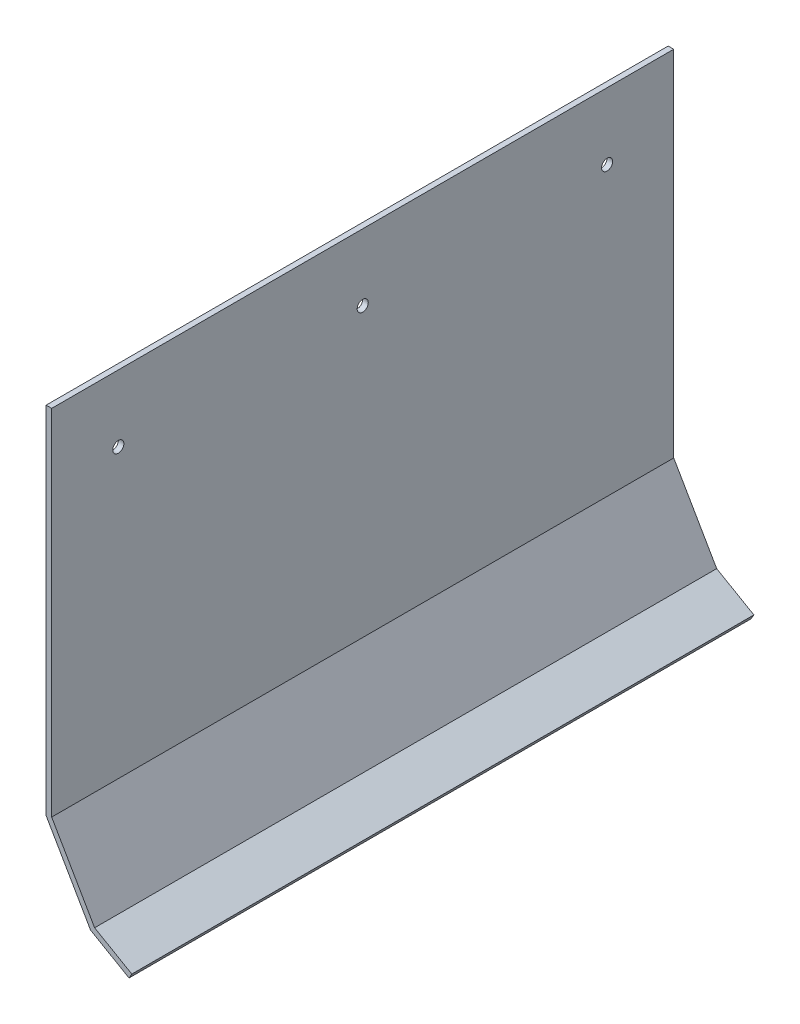
ISO-10303-21;
HEADER;
FILE_DESCRIPTION(('STEP AP214'),'2;1');
FILE_NAME('part.step','',(''),(''),'','','');
FILE_SCHEMA(('AUTOMOTIVE_DESIGN { 1 0 10303 214 1 1 1 1 }'));
ENDSEC;
DATA;
#1=APPLICATION_CONTEXT('core data for automotive mechanical design processes');
#2=APPLICATION_PROTOCOL_DEFINITION('international standard','automotive_design',2000,#1);
#3=PRODUCT_CONTEXT('',#1,'mechanical');
#4=PRODUCT('Part','Part','',(#3));
#5=PRODUCT_RELATED_PRODUCT_CATEGORY('part','',(#4));
#6=PRODUCT_DEFINITION_FORMATION('','',#4);
#7=PRODUCT_DEFINITION_CONTEXT('part definition',#1,'design');
#8=PRODUCT_DEFINITION('design','',#6,#7);
#9=PRODUCT_DEFINITION_SHAPE('','',#8);
#10=(LENGTH_UNIT() NAMED_UNIT(*) SI_UNIT(.MILLI.,.METRE.));
#11=(NAMED_UNIT(*) PLANE_ANGLE_UNIT() SI_UNIT($,.RADIAN.));
#12=(NAMED_UNIT(*) SI_UNIT($,.STERADIAN.) SOLID_ANGLE_UNIT());
#13=UNCERTAINTY_MEASURE_WITH_UNIT(LENGTH_MEASURE(1.E-05),#10,'distance_accuracy_value','');
#14=(GEOMETRIC_REPRESENTATION_CONTEXT(3) GLOBAL_UNCERTAINTY_ASSIGNED_CONTEXT((#13)) GLOBAL_UNIT_ASSIGNED_CONTEXT((#10,
#11,#12)) REPRESENTATION_CONTEXT('',''));
#15=CARTESIAN_POINT('',(0.,0.,0.));
#16=DIRECTION('',(0.,0.,1.));
#17=DIRECTION('',(1.,0.,0.));
#18=AXIS2_PLACEMENT_3D('',#15,#16,#17);
#19=CARTESIAN_POINT('',(-34.4420782014583,67.4309013813476,177.8));
#20=DIRECTION('',(1.,0.,0.));
#21=DIRECTION('',(0.,1.,0.));
#22=AXIS2_PLACEMENT_3D('',#19,#20,#21);
#23=PLANE('',#22);
#24=CARTESIAN_POINT('',(-34.4420782014583,48.3809013813468,158.75));
#25=DIRECTION('',(-1.,0.,0.));
#26=DIRECTION('',(0.,-1.,0.));
#27=AXIS2_PLACEMENT_3D('',#24,#25,#26);
#28=CIRCLE('',#27,1.58749999999999);
#29=CARTESIAN_POINT('',(-34.4420782014583,46.7934013813468,158.75));
#30=VERTEX_POINT('',#29);
#31=EDGE_CURVE('E186',#30,#30,#28,.T.);
#32=ORIENTED_EDGE('',*,*,#31,.F.);
#33=EDGE_LOOP('',(#32));
#34=FACE_BOUND('',#33,.T.);
#35=CARTESIAN_POINT('',(-34.4420782014583,48.3809013813468,88.9));
#36=DIRECTION('',(-1.,0.,0.));
#37=DIRECTION('',(0.,-1.,0.));
#38=AXIS2_PLACEMENT_3D('',#35,#36,#37);
#39=CIRCLE('',#38,1.5875);
#40=CARTESIAN_POINT('',(-34.4420782014583,46.7934013813468,88.9));
#41=VERTEX_POINT('',#40);
#42=EDGE_CURVE('E220',#41,#41,#39,.T.);
#43=ORIENTED_EDGE('',*,*,#42,.F.);
#44=EDGE_LOOP('',(#43));
#45=FACE_BOUND('',#44,.T.);
#46=CARTESIAN_POINT('',(-34.4420782014583,48.3809013813468,19.05));
#47=DIRECTION('',(-1.,0.,0.));
#48=DIRECTION('',(0.,-1.,0.));
#49=AXIS2_PLACEMENT_3D('',#46,#47,#48);
#50=CIRCLE('',#49,1.5875);
#51=CARTESIAN_POINT('',(-34.4420782014583,46.7934013813468,19.05));
#52=VERTEX_POINT('',#51);
#53=EDGE_CURVE('E224',#52,#52,#50,.T.);
#54=ORIENTED_EDGE('',*,*,#53,.F.);
#55=EDGE_LOOP('',(#54));
#56=FACE_BOUND('',#55,.T.);
#57=DIRECTION('',(0.,-1.,0.));
#58=VECTOR('',#57,1.);
#59=CARTESIAN_POINT('',(-34.4420782014583,67.4309013813476,0.));
#60=LINE('',#59,#58);
#61=CARTESIAN_POINT('',(-34.4420782014583,67.4309013813476,0.));
#62=VERTEX_POINT('',#61);
#63=CARTESIAN_POINT('',(-34.4420782014583,-34.1690986186524,0.));
#64=VERTEX_POINT('',#63);
#65=EDGE_CURVE('E142',#62,#64,#60,.T.);
#66=ORIENTED_EDGE('',*,*,#65,.T.);
#67=DIRECTION('',(0.,0.,-1.));
#68=VECTOR('',#67,1.);
#69=CARTESIAN_POINT('',(-34.4420782014583,-34.1690986186524,177.8));
#70=LINE('',#69,#68);
#71=CARTESIAN_POINT('',(-34.4420782014583,-34.1690986186524,177.8));
#72=VERTEX_POINT('',#71);
#73=EDGE_CURVE('E11',#72,#64,#70,.T.);
#74=ORIENTED_EDGE('',*,*,#73,.F.);
#75=DIRECTION('',(0.,-1.,0.));
#76=VECTOR('',#75,1.);
#77=CARTESIAN_POINT('',(-34.4420782014583,67.4309013813476,177.8));
#78=LINE('',#77,#76);
#79=CARTESIAN_POINT('',(-34.4420782014583,67.4309013813476,177.8));
#80=VERTEX_POINT('',#79);
#81=EDGE_CURVE('E164',#80,#72,#78,.T.);
#82=ORIENTED_EDGE('',*,*,#81,.F.);
#83=DIRECTION('',(0.,0.,-1.));
#84=VECTOR('',#83,1.);
#85=CARTESIAN_POINT('',(-34.4420782014583,67.4309013813476,177.8));
#86=LINE('',#85,#84);
#87=EDGE_CURVE('E138',#80,#62,#86,.T.);
#88=ORIENTED_EDGE('',*,*,#87,.T.);
#89=EDGE_LOOP('',(#66,#74,#82,#88));
#90=FACE_BOUND('',#89,.T.);
#91=ADVANCED_FACE('F39',(#34,#45,#56,#90),#23,.F.);
#92=CARTESIAN_POINT('',(-34.4420782014583,-34.1690986186524,177.8));
#93=DIRECTION('',(0.866025403784442,0.499999999999994,0.));
#94=DIRECTION('',(-0.499999999999994,0.866025403784442,0.));
#95=AXIS2_PLACEMENT_3D('',#92,#93,#94);
#96=PLANE('',#95);
#97=DIRECTION('',(0.499999999999994,-0.866025403784442,0.));
#98=VECTOR('',#97,1.);
#99=CARTESIAN_POINT('',(-34.4420782014583,-34.1690986186524,0.));
#100=LINE('',#99,#98);
#101=CARTESIAN_POINT('',(-21.7420782014584,-56.1661438747772,0.));
#102=VERTEX_POINT('',#101);
#103=EDGE_CURVE('E146',#64,#102,#100,.T.);
#104=ORIENTED_EDGE('',*,*,#103,.T.);
#105=DIRECTION('',(0.,0.,-1.));
#106=VECTOR('',#105,1.);
#107=CARTESIAN_POINT('',(-21.7420782014584,-56.1661438747772,177.8));
#108=LINE('',#107,#106);
#109=CARTESIAN_POINT('',(-21.7420782014584,-56.1661438747772,177.8));
#110=VERTEX_POINT('',#109);
#111=EDGE_CURVE('E49',#110,#102,#108,.T.);
#112=ORIENTED_EDGE('',*,*,#111,.F.);
#113=DIRECTION('',(0.499999999999994,-0.866025403784442,0.));
#114=VECTOR('',#113,1.);
#115=CARTESIAN_POINT('',(-34.4420782014583,-34.1690986186524,177.8));
#116=LINE('',#115,#114);
#117=EDGE_CURVE('E101',#72,#110,#116,.T.);
#118=ORIENTED_EDGE('',*,*,#117,.F.);
#119=ORIENTED_EDGE('',*,*,#73,.T.);
#120=EDGE_LOOP('',(#104,#112,#118,#119));
#121=FACE_BOUND('',#120,.T.);
#122=ADVANCED_FACE('F209',(#121),#96,.F.);
#123=CARTESIAN_POINT('',(-21.7420782014584,-56.1661438747772,177.8));
#124=DIRECTION('',(0.500000000000005,0.866025403784436,0.));
#125=DIRECTION('',(-0.866025403784436,0.500000000000005,0.));
#126=AXIS2_PLACEMENT_3D('',#123,#124,#125);
#127=PLANE('',#126);
#128=DIRECTION('',(0.866025403784436,-0.500000000000004,0.));
#129=VECTOR('',#128,1.);
#130=CARTESIAN_POINT('',(-21.7420782014584,-56.1661438747772,0.));
#131=LINE('',#130,#129);
#132=CARTESIAN_POINT('',(-10.7435555733961,-62.5161438747772,0.));
#133=VERTEX_POINT('',#132);
#134=EDGE_CURVE('E149',#102,#133,#131,.T.);
#135=ORIENTED_EDGE('',*,*,#134,.T.);
#136=DIRECTION('',(0.,0.,-1.));
#137=VECTOR('',#136,1.);
#138=CARTESIAN_POINT('',(-10.7435555733961,-62.5161438747772,177.8));
#139=LINE('',#138,#137);
#140=CARTESIAN_POINT('',(-10.7435555733961,-62.5161438747772,177.8));
#141=VERTEX_POINT('',#140);
#142=EDGE_CURVE('E175',#141,#133,#139,.T.);
#143=ORIENTED_EDGE('',*,*,#142,.F.);
#144=DIRECTION('',(0.866025403784436,-0.500000000000004,0.));
#145=VECTOR('',#144,1.);
#146=CARTESIAN_POINT('',(-21.7420782014584,-56.1661438747772,177.8));
#147=LINE('',#146,#145);
#148=EDGE_CURVE('E235',#110,#141,#147,.T.);
#149=ORIENTED_EDGE('',*,*,#148,.F.);
#150=ORIENTED_EDGE('',*,*,#111,.T.);
#151=EDGE_LOOP('',(#135,#143,#149,#150));
#152=FACE_BOUND('',#151,.T.);
#153=ADVANCED_FACE('F214',(#152),#127,.F.);
#154=CARTESIAN_POINT('',(-10.7435555733961,-62.5161438747772,177.8));
#155=DIRECTION('',(-0.866025403784438,0.500000000000002,0.));
#156=DIRECTION('',(-0.500000000000002,-0.866025403784438,0.));
#157=AXIS2_PLACEMENT_3D('',#154,#155,#156);
#158=PLANE('',#157);
#159=DIRECTION('',(0.500000000000002,0.866025403784438,0.));
#160=VECTOR('',#159,1.);
#161=CARTESIAN_POINT('',(-10.7435555733961,-62.5161438747772,0.));
#162=LINE('',#161,#160);
#163=CARTESIAN_POINT('',(-9.94980557339608,-61.1413285462694,0.));
#164=VERTEX_POINT('',#163);
#165=EDGE_CURVE('E152',#133,#164,#162,.T.);
#166=ORIENTED_EDGE('',*,*,#165,.T.);
#167=DIRECTION('',(0.,0.,-1.));
#168=VECTOR('',#167,1.);
#169=CARTESIAN_POINT('',(-9.94980557339608,-61.1413285462694,177.8));
#170=LINE('',#169,#168);
#171=CARTESIAN_POINT('',(-9.94980557339608,-61.1413285462694,177.8));
#172=VERTEX_POINT('',#171);
#173=EDGE_CURVE('E171',#172,#164,#170,.T.);
#174=ORIENTED_EDGE('',*,*,#173,.F.);
#175=DIRECTION('',(0.500000000000002,0.866025403784438,0.));
#176=VECTOR('',#175,1.);
#177=CARTESIAN_POINT('',(-10.7435555733961,-62.5161438747772,177.8));
#178=LINE('',#177,#176);
#179=EDGE_CURVE('E238',#141,#172,#178,.T.);
#180=ORIENTED_EDGE('',*,*,#179,.F.);
#181=ORIENTED_EDGE('',*,*,#142,.T.);
#182=EDGE_LOOP('',(#166,#174,#180,#181));
#183=FACE_BOUND('',#182,.T.);
#184=ADVANCED_FACE('F274',(#183),#158,.F.);
#185=CARTESIAN_POINT('',(-9.94980557339608,-61.1413285462694,177.8));
#186=DIRECTION('',(-0.500000000000004,-0.866025403784436,0.));
#187=DIRECTION('',(0.866025403784436,-0.500000000000005,0.));
#188=AXIS2_PLACEMENT_3D('',#185,#186,#187);
#189=PLANE('',#188);
#190=DIRECTION('',(-0.866025403784436,0.500000000000005,0.));
#191=VECTOR('',#190,1.);
#192=CARTESIAN_POINT('',(-9.94980557339608,-61.1413285462694,0.));
#193=LINE('',#192,#191);
#194=CARTESIAN_POINT('',(-20.5799475444428,-55.0040132177616,0.));
#195=VERTEX_POINT('',#194);
#196=EDGE_CURVE('E155',#164,#195,#193,.T.);
#197=ORIENTED_EDGE('',*,*,#196,.T.);
#198=DIRECTION('',(0.,0.,-1.));
#199=VECTOR('',#198,1.);
#200=CARTESIAN_POINT('',(-20.5799475444428,-55.0040132177616,177.8));
#201=LINE('',#200,#199);
#202=CARTESIAN_POINT('',(-20.5799475444428,-55.0040132177616,177.8));
#203=VERTEX_POINT('',#202);
#204=EDGE_CURVE('E131',#203,#195,#201,.T.);
#205=ORIENTED_EDGE('',*,*,#204,.F.);
#206=DIRECTION('',(-0.866025403784436,0.500000000000005,0.));
#207=VECTOR('',#206,1.);
#208=CARTESIAN_POINT('',(-9.94980557339608,-61.1413285462694,177.8));
#209=LINE('',#208,#207);
#210=EDGE_CURVE('E120',#172,#203,#209,.T.);
#211=ORIENTED_EDGE('',*,*,#210,.F.);
#212=ORIENTED_EDGE('',*,*,#173,.T.);
#213=EDGE_LOOP('',(#197,#205,#211,#212));
#214=FACE_BOUND('',#213,.T.);
#215=ADVANCED_FACE('F268',(#214),#189,.F.);
#216=CARTESIAN_POINT('',(-20.5799475444428,-55.0040132177616,177.8));
#217=DIRECTION('',(-0.866025403784448,-0.499999999999984,0.));
#218=DIRECTION('',(0.499999999999984,-0.866025403784448,0.));
#219=AXIS2_PLACEMENT_3D('',#216,#217,#218);
#220=PLANE('',#219);
#221=DIRECTION('',(-0.499999999999984,0.866025403784448,0.));
#222=VECTOR('',#221,1.);
#223=CARTESIAN_POINT('',(-20.5799475444428,-55.0040132177616,0.));
#224=LINE('',#223,#222);
#225=CARTESIAN_POINT('',(-32.8545782014574,-33.7437292756688,0.));
#226=VERTEX_POINT('',#225);
#227=EDGE_CURVE('E129',#195,#226,#224,.T.);
#228=ORIENTED_EDGE('',*,*,#227,.T.);
#229=DIRECTION('',(0.,0.,-1.));
#230=VECTOR('',#229,1.);
#231=CARTESIAN_POINT('',(-32.8545782014574,-33.7437292756688,177.8));
#232=LINE('',#231,#230);
#233=CARTESIAN_POINT('',(-32.8545782014574,-33.7437292756688,177.8));
#234=VERTEX_POINT('',#233);
#235=EDGE_CURVE('E126',#234,#226,#232,.T.);
#236=ORIENTED_EDGE('',*,*,#235,.F.);
#237=DIRECTION('',(-0.499999999999984,0.866025403784448,0.));
#238=VECTOR('',#237,1.);
#239=CARTESIAN_POINT('',(-20.5799475444428,-55.0040132177616,177.8));
#240=LINE('',#239,#238);
#241=EDGE_CURVE('E114',#203,#234,#240,.T.);
#242=ORIENTED_EDGE('',*,*,#241,.F.);
#243=ORIENTED_EDGE('',*,*,#204,.T.);
#244=EDGE_LOOP('',(#228,#236,#242,#243));
#245=FACE_BOUND('',#244,.T.);
#246=ADVANCED_FACE('F127',(#245),#220,.F.);
#247=CARTESIAN_POINT('',(-32.8545782014574,67.4309013813468,177.8));
#248=DIRECTION('',(-1.,0.,0.));
#249=DIRECTION('',(0.,0.,1.));
#250=AXIS2_PLACEMENT_3D('',#247,#248,#249);
#251=PLANE('',#250);
#252=CARTESIAN_POINT('',(-32.8545782014574,48.3809013813468,158.75));
#253=DIRECTION('',(-1.,0.,0.));
#254=DIRECTION('',(0.,0.,1.));
#255=AXIS2_PLACEMENT_3D('',#252,#253,#254);
#256=CIRCLE('',#255,1.58749999999999);
#257=CARTESIAN_POINT('',(-32.8545782014574,48.3809013813468,160.3375));
#258=VERTEX_POINT('',#257);
#259=EDGE_CURVE('E42',#258,#258,#256,.T.);
#260=ORIENTED_EDGE('',*,*,#259,.T.);
#261=EDGE_LOOP('',(#260));
#262=FACE_BOUND('',#261,.T.);
#263=CARTESIAN_POINT('',(-32.8545782014574,48.3809013813468,88.9));
#264=DIRECTION('',(-1.,0.,0.));
#265=DIRECTION('',(0.,0.,1.));
#266=AXIS2_PLACEMENT_3D('',#263,#264,#265);
#267=CIRCLE('',#266,1.5875);
#268=CARTESIAN_POINT('',(-32.8545782014574,48.3809013813468,90.4875));
#269=VERTEX_POINT('',#268);
#270=EDGE_CURVE('E185',#269,#269,#267,.T.);
#271=ORIENTED_EDGE('',*,*,#270,.T.);
#272=EDGE_LOOP('',(#271));
#273=FACE_BOUND('',#272,.T.);
#274=CARTESIAN_POINT('',(-32.8545782014574,48.3809013813468,19.05));
#275=DIRECTION('',(-1.,0.,0.));
#276=DIRECTION('',(0.,0.,1.));
#277=AXIS2_PLACEMENT_3D('',#274,#275,#276);
#278=CIRCLE('',#277,1.5875);
#279=CARTESIAN_POINT('',(-32.8545782014574,48.3809013813468,20.6375));
#280=VERTEX_POINT('',#279);
#281=EDGE_CURVE('E182',#280,#280,#278,.T.);
#282=ORIENTED_EDGE('',*,*,#281,.T.);
#283=EDGE_LOOP('',(#282));
#284=FACE_BOUND('',#283,.T.);
#285=DIRECTION('',(0.,1.,0.));
#286=VECTOR('',#285,1.);
#287=CARTESIAN_POINT('',(-32.8545782014574,67.4309013813468,0.));
#288=LINE('',#287,#286);
#289=CARTESIAN_POINT('',(-32.8545782014574,67.4309013813468,0.));
#290=VERTEX_POINT('',#289);
#291=EDGE_CURVE('E87',#226,#290,#288,.T.);
#292=ORIENTED_EDGE('',*,*,#291,.T.);
#293=DIRECTION('',(0.,0.,-1.));
#294=VECTOR('',#293,1.);
#295=CARTESIAN_POINT('',(-32.8545782014574,67.4309013813468,177.8));
#296=LINE('',#295,#294);
#297=CARTESIAN_POINT('',(-32.8545782014574,67.4309013813468,177.8));
#298=VERTEX_POINT('',#297);
#299=EDGE_CURVE('E132',#298,#290,#296,.T.);
#300=ORIENTED_EDGE('',*,*,#299,.F.);
#301=DIRECTION('',(0.,1.,0.));
#302=VECTOR('',#301,1.);
#303=CARTESIAN_POINT('',(-32.8545782014574,67.4309013813468,177.8));
#304=LINE('',#303,#302);
#305=EDGE_CURVE('E118',#234,#298,#304,.T.);
#306=ORIENTED_EDGE('',*,*,#305,.F.);
#307=ORIENTED_EDGE('',*,*,#235,.T.);
#308=EDGE_LOOP('',(#292,#300,#306,#307));
#309=FACE_BOUND('',#308,.T.);
#310=ADVANCED_FACE('F134',(#262,#273,#284,#309),#251,.F.);
#311=CARTESIAN_POINT('',(-34.4420782014583,67.4309013813476,177.8));
#312=DIRECTION('',(-5.41998641942699E-13,-1.,0.));
#313=DIRECTION('',(1.,-5.41998641942699E-13,0.));
#314=AXIS2_PLACEMENT_3D('',#311,#312,#313);
#315=PLANE('',#314);
#316=DIRECTION('',(-1.,5.41998641942699E-13,0.));
#317=VECTOR('',#316,1.);
#318=CARTESIAN_POINT('',(-34.4420782014583,67.4309013813476,0.));
#319=LINE('',#318,#317);
#320=EDGE_CURVE('E93',#290,#62,#319,.T.);
#321=ORIENTED_EDGE('',*,*,#320,.T.);
#322=ORIENTED_EDGE('',*,*,#87,.F.);
#323=DIRECTION('',(-1.,5.41998641942699E-13,0.));
#324=VECTOR('',#323,1.);
#325=CARTESIAN_POINT('',(-34.4420782014583,67.4309013813476,177.8));
#326=LINE('',#325,#324);
#327=EDGE_CURVE('E58',#298,#80,#326,.T.);
#328=ORIENTED_EDGE('',*,*,#327,.F.);
#329=ORIENTED_EDGE('',*,*,#299,.T.);
#330=EDGE_LOOP('',(#321,#322,#328,#329));
#331=FACE_BOUND('',#330,.T.);
#332=ADVANCED_FACE('F261',(#331),#315,.F.);
#333=CARTESIAN_POINT('',(0.,0.,177.8));
#334=DIRECTION('',(0.,0.,1.));
#335=DIRECTION('',(1.,0.,0.));
#336=AXIS2_PLACEMENT_3D('',#333,#334,#335);
#337=PLANE('',#336);
#338=ORIENTED_EDGE('',*,*,#81,.T.);
#339=ORIENTED_EDGE('',*,*,#117,.T.);
#340=ORIENTED_EDGE('',*,*,#148,.T.);
#341=ORIENTED_EDGE('',*,*,#179,.T.);
#342=ORIENTED_EDGE('',*,*,#210,.T.);
#343=ORIENTED_EDGE('',*,*,#241,.T.);
#344=ORIENTED_EDGE('',*,*,#305,.T.);
#345=ORIENTED_EDGE('',*,*,#327,.T.);
#346=EDGE_LOOP('',(#338,#339,#340,#341,#342,#343,#344,#345));
#347=FACE_BOUND('',#346,.T.);
#348=ADVANCED_FACE('F116',(#347),#337,.T.);
#349=CARTESIAN_POINT('',(0.,0.,0.));
#350=DIRECTION('',(0.,0.,1.));
#351=DIRECTION('',(1.,0.,0.));
#352=AXIS2_PLACEMENT_3D('',#349,#350,#351);
#353=PLANE('',#352);
#354=ORIENTED_EDGE('',*,*,#65,.F.);
#355=ORIENTED_EDGE('',*,*,#320,.F.);
#356=ORIENTED_EDGE('',*,*,#291,.F.);
#357=ORIENTED_EDGE('',*,*,#227,.F.);
#358=ORIENTED_EDGE('',*,*,#196,.F.);
#359=ORIENTED_EDGE('',*,*,#165,.F.);
#360=ORIENTED_EDGE('',*,*,#134,.F.);
#361=ORIENTED_EDGE('',*,*,#103,.F.);
#362=EDGE_LOOP('',(#354,#355,#356,#357,#358,#359,#360,#361));
#363=FACE_BOUND('',#362,.T.);
#364=ADVANCED_FACE('F229',(#363),#353,.F.);
#365=CARTESIAN_POINT('',(219.557921798542,48.3809013813468,19.05));
#366=DIRECTION('',(-1.,0.,0.));
#367=DIRECTION('',(0.,-1.,0.));
#368=AXIS2_PLACEMENT_3D('',#365,#366,#367);
#369=CYLINDRICAL_SURFACE('',#368,1.5875);
#370=ORIENTED_EDGE('',*,*,#53,.T.);
#371=EDGE_LOOP('',(#370));
#372=FACE_BOUND('',#371,.T.);
#373=ORIENTED_EDGE('',*,*,#281,.F.);
#374=EDGE_LOOP('',(#373));
#375=FACE_BOUND('',#374,.T.);
#376=ADVANCED_FACE('F204',(#372,#375),#369,.F.);
#377=CARTESIAN_POINT('',(219.557921798542,48.3809013813468,88.9));
#378=DIRECTION('',(-1.,0.,0.));
#379=DIRECTION('',(0.,-1.,0.));
#380=AXIS2_PLACEMENT_3D('',#377,#378,#379);
#381=CYLINDRICAL_SURFACE('',#380,1.5875);
#382=ORIENTED_EDGE('',*,*,#42,.T.);
#383=EDGE_LOOP('',(#382));
#384=FACE_BOUND('',#383,.T.);
#385=ORIENTED_EDGE('',*,*,#270,.F.);
#386=EDGE_LOOP('',(#385));
#387=FACE_BOUND('',#386,.T.);
#388=ADVANCED_FACE('F198',(#384,#387),#381,.F.);
#389=CARTESIAN_POINT('',(219.557921798542,48.3809013813468,158.75));
#390=DIRECTION('',(-1.,0.,0.));
#391=DIRECTION('',(0.,-1.,0.));
#392=AXIS2_PLACEMENT_3D('',#389,#390,#391);
#393=CYLINDRICAL_SURFACE('',#392,1.58749999999999);
#394=ORIENTED_EDGE('',*,*,#31,.T.);
#395=EDGE_LOOP('',(#394));
#396=FACE_BOUND('',#395,.T.);
#397=ORIENTED_EDGE('',*,*,#259,.F.);
#398=EDGE_LOOP('',(#397));
#399=FACE_BOUND('',#398,.T.);
#400=ADVANCED_FACE('F196',(#396,#399),#393,.F.);
#401=CLOSED_SHELL('',(#91,#122,#153,#184,#215,#246,#310,#332,#348,#364,#376,#388,#400));
#402=MANIFOLD_SOLID_BREP('B2',#401);
#403=ADVANCED_BREP_SHAPE_REPRESENTATION('',(#18,#402),#14);
#404=SHAPE_DEFINITION_REPRESENTATION(#9,#403);
ENDSEC;
END-ISO-10303-21;
